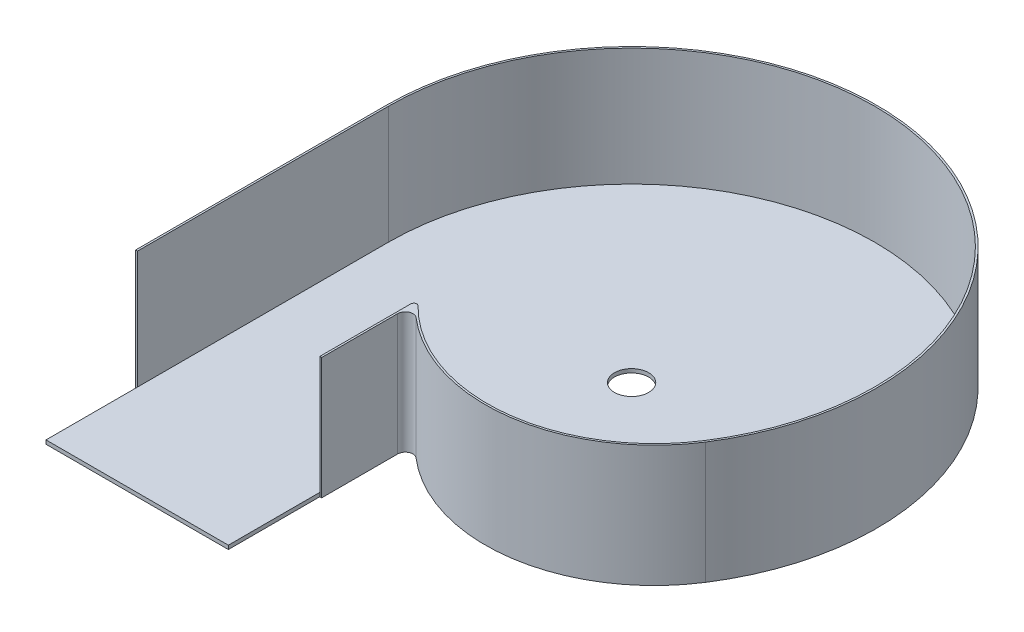
ISO-10303-21;
HEADER;
FILE_DESCRIPTION(('STEP AP214'),'2;1');
FILE_NAME('part.step','',(''),(''),'','','');
FILE_SCHEMA(('AUTOMOTIVE_DESIGN { 1 0 10303 214 1 1 1 1 }'));
ENDSEC;
DATA;
#1=APPLICATION_CONTEXT('core data for automotive mechanical design processes');
#2=APPLICATION_PROTOCOL_DEFINITION('international standard','automotive_design',2000,#1);
#3=PRODUCT_CONTEXT('',#1,'mechanical');
#4=PRODUCT('Part','Part','',(#3));
#5=PRODUCT_RELATED_PRODUCT_CATEGORY('part','',(#4));
#6=PRODUCT_DEFINITION_FORMATION('','',#4);
#7=PRODUCT_DEFINITION_CONTEXT('part definition',#1,'design');
#8=PRODUCT_DEFINITION('design','',#6,#7);
#9=PRODUCT_DEFINITION_SHAPE('','',#8);
#10=(LENGTH_UNIT() NAMED_UNIT(*) SI_UNIT(.MILLI.,.METRE.));
#11=(NAMED_UNIT(*) PLANE_ANGLE_UNIT() SI_UNIT($,.RADIAN.));
#12=(NAMED_UNIT(*) SI_UNIT($,.STERADIAN.) SOLID_ANGLE_UNIT());
#13=UNCERTAINTY_MEASURE_WITH_UNIT(LENGTH_MEASURE(1.E-05),#10,'distance_accuracy_value','');
#14=(GEOMETRIC_REPRESENTATION_CONTEXT(3) GLOBAL_UNCERTAINTY_ASSIGNED_CONTEXT((#13)) GLOBAL_UNIT_ASSIGNED_CONTEXT((#10,
#11,#12)) REPRESENTATION_CONTEXT('',''));
#15=CARTESIAN_POINT('',(0.,0.,0.));
#16=DIRECTION('',(0.,0.,1.));
#17=DIRECTION('',(1.,0.,0.));
#18=AXIS2_PLACEMENT_3D('',#15,#16,#17);
#19=CARTESIAN_POINT('',(0.,101.6,0.));
#20=DIRECTION('',(0.,-1.,0.));
#21=DIRECTION('',(0.,0.,-1.));
#22=AXIS2_PLACEMENT_3D('',#19,#20,#21);
#23=CYLINDRICAL_SURFACE('',#22,203.2);
#24=DIRECTION('',(0.,-1.,0.));
#25=VECTOR('',#24,1.);
#26=CARTESIAN_POINT('',(-203.2,101.6,0.));
#27=LINE('',#26,#25);
#28=CARTESIAN_POINT('',(-203.2,101.6,0.));
#29=VERTEX_POINT('',#28);
#30=CARTESIAN_POINT('',(-203.2,3.175,0.));
#31=VERTEX_POINT('',#30);
#32=EDGE_CURVE('E224',#29,#31,#27,.T.);
#33=ORIENTED_EDGE('',*,*,#32,.T.);
#34=CARTESIAN_POINT('',(0.,3.175,0.));
#35=DIRECTION('',(0.,1.,0.));
#36=DIRECTION('',(0.,0.,1.));
#37=AXIS2_PLACEMENT_3D('',#34,#35,#36);
#38=CIRCLE('',#37,203.2);
#39=CARTESIAN_POINT('',(170.948853632073,3.175,109.848666090582));
#40=VERTEX_POINT('',#39);
#41=EDGE_CURVE('E57',#40,#31,#38,.T.);
#42=ORIENTED_EDGE('',*,*,#41,.F.);
#43=DIRECTION('',(0.,-1.,0.));
#44=VECTOR('',#43,1.);
#45=CARTESIAN_POINT('',(170.948853632073,101.6,109.848666090582));
#46=LINE('',#45,#44);
#47=CARTESIAN_POINT('',(170.948853632073,101.6,109.848666090582));
#48=VERTEX_POINT('',#47);
#49=EDGE_CURVE('E11',#48,#40,#46,.T.);
#50=ORIENTED_EDGE('',*,*,#49,.F.);
#51=CARTESIAN_POINT('',(0.,101.6,0.));
#52=DIRECTION('',(0.,-1.,0.));
#53=DIRECTION('',(0.,0.,1.));
#54=AXIS2_PLACEMENT_3D('',#51,#52,#53);
#55=CIRCLE('',#54,203.2);
#56=EDGE_CURVE('E198',#29,#48,#55,.T.);
#57=ORIENTED_EDGE('',*,*,#56,.F.);
#58=EDGE_LOOP('',(#33,#42,#50,#57));
#59=FACE_BOUND('',#58,.T.);
#60=ADVANCED_FACE('F43',(#59),#23,.F.);
#61=CARTESIAN_POINT('',(53.4215167600227,101.6,34.3277081533069));
#62=DIRECTION('',(0.,-1.,0.));
#63=DIRECTION('',(0.,0.,-1.));
#64=AXIS2_PLACEMENT_3D('',#61,#62,#63);
#65=CYLINDRICAL_SURFACE('',#64,139.7);
#66=ORIENTED_EDGE('',*,*,#49,.T.);
#67=CARTESIAN_POINT('',(53.4215167600227,3.175,34.3277081533069));
#68=DIRECTION('',(0.,1.,0.));
#69=DIRECTION('',(0.,0.,1.));
#70=AXIS2_PLACEMENT_3D('',#67,#68,#69);
#71=CIRCLE('',#70,139.7);
#72=CARTESIAN_POINT('',(-46.4442586292853,3.175,132.01556259741));
#73=VERTEX_POINT('',#72);
#74=EDGE_CURVE('E63',#73,#40,#71,.T.);
#75=ORIENTED_EDGE('',*,*,#74,.F.);
#76=DIRECTION('',(0.,-1.,0.));
#77=VECTOR('',#76,1.);
#78=CARTESIAN_POINT('',(-46.4442586292853,101.6,132.01556259741));
#79=LINE('',#78,#77);
#80=CARTESIAN_POINT('',(-46.4442586292853,101.6,132.01556259741));
#81=VERTEX_POINT('',#80);
#82=EDGE_CURVE('E50',#81,#73,#79,.T.);
#83=ORIENTED_EDGE('',*,*,#82,.F.);
#84=CARTESIAN_POINT('',(53.4215167600227,101.6,34.3277081533069));
#85=DIRECTION('',(0.,-1.,0.));
#86=DIRECTION('',(0.,0.,1.));
#87=AXIS2_PLACEMENT_3D('',#84,#85,#86);
#88=CIRCLE('',#87,139.7);
#89=EDGE_CURVE('E201',#48,#81,#88,.T.);
#90=ORIENTED_EDGE('',*,*,#89,.F.);
#91=EDGE_LOOP('',(#66,#75,#83,#90));
#92=FACE_BOUND('',#91,.T.);
#93=ADVANCED_FACE('F293',(#92),#65,.F.);
#94=CARTESIAN_POINT('',(-48.26,101.6,133.791705405485));
#95=DIRECTION('',(0.,-1.,0.));
#96=DIRECTION('',(0.,0.,-1.));
#97=AXIS2_PLACEMENT_3D('',#94,#95,#96);
#98=CYLINDRICAL_SURFACE('',#97,2.54);
#99=ORIENTED_EDGE('',*,*,#82,.T.);
#100=CARTESIAN_POINT('',(-48.26,3.175,133.791705405485));
#101=DIRECTION('',(0.,-1.,0.));
#102=DIRECTION('',(0.,0.,1.));
#103=AXIS2_PLACEMENT_3D('',#100,#101,#102);
#104=CIRCLE('',#103,2.54);
#105=CARTESIAN_POINT('',(-50.8,3.175,133.791705405485));
#106=VERTEX_POINT('',#105);
#107=EDGE_CURVE('E182',#106,#73,#104,.T.);
#108=ORIENTED_EDGE('',*,*,#107,.F.);
#109=DIRECTION('',(0.,-1.,0.));
#110=VECTOR('',#109,1.);
#111=CARTESIAN_POINT('',(-50.8,101.6,133.791705405485));
#112=LINE('',#111,#110);
#113=CARTESIAN_POINT('',(-50.8,101.6,133.791705405485));
#114=VERTEX_POINT('',#113);
#115=EDGE_CURVE('E262',#114,#106,#112,.T.);
#116=ORIENTED_EDGE('',*,*,#115,.F.);
#117=CARTESIAN_POINT('',(-48.26,101.6,133.791705405485));
#118=DIRECTION('',(0.,1.,0.));
#119=DIRECTION('',(0.,0.,1.));
#120=AXIS2_PLACEMENT_3D('',#117,#118,#119);
#121=CIRCLE('',#120,2.54);
#122=EDGE_CURVE('E204',#81,#114,#121,.T.);
#123=ORIENTED_EDGE('',*,*,#122,.F.);
#124=EDGE_LOOP('',(#99,#108,#116,#123));
#125=FACE_BOUND('',#124,.T.);
#126=ADVANCED_FACE('F266',(#125),#98,.T.);
#127=CARTESIAN_POINT('',(-50.8,101.6,209.748302874768));
#128=DIRECTION('',(1.,0.,0.));
#129=DIRECTION('',(0.,0.,-1.));
#130=AXIS2_PLACEMENT_3D('',#127,#128,#129);
#131=PLANE('',#130);
#132=ORIENTED_EDGE('',*,*,#115,.T.);
#133=DIRECTION('',(0.,0.,-1.));
#134=VECTOR('',#133,1.);
#135=CARTESIAN_POINT('',(-50.8,3.175,133.791705405485));
#136=LINE('',#135,#134);
#137=CARTESIAN_POINT('',(-50.8,3.175,209.748302874768));
#138=VERTEX_POINT('',#137);
#139=EDGE_CURVE('E175',#138,#106,#136,.T.);
#140=ORIENTED_EDGE('',*,*,#139,.F.);
#141=DIRECTION('',(0.,-1.,0.));
#142=VECTOR('',#141,1.);
#143=CARTESIAN_POINT('',(-50.8,101.6,209.748302874768));
#144=LINE('',#143,#142);
#145=CARTESIAN_POINT('',(-50.8,101.6,209.748302874768));
#146=VERTEX_POINT('',#145);
#147=EDGE_CURVE('E259',#146,#138,#144,.T.);
#148=ORIENTED_EDGE('',*,*,#147,.F.);
#149=DIRECTION('',(0.,0.,1.));
#150=VECTOR('',#149,1.);
#151=CARTESIAN_POINT('',(-50.8,101.6,196.747553987337));
#152=LINE('',#151,#150);
#153=EDGE_CURVE('E206',#114,#146,#152,.T.);
#154=ORIENTED_EDGE('',*,*,#153,.F.);
#155=EDGE_LOOP('',(#132,#140,#148,#154));
#156=FACE_BOUND('',#155,.T.);
#157=ADVANCED_FACE('F270',(#156),#131,.F.);
#158=CARTESIAN_POINT('',(-49.2125,101.6,209.748302874768));
#159=DIRECTION('',(0.,0.,-1.));
#160=DIRECTION('',(-1.,0.,0.));
#161=AXIS2_PLACEMENT_3D('',#158,#159,#160);
#162=PLANE('',#161);
#163=DIRECTION('',(1.,0.,0.));
#164=VECTOR('',#163,1.);
#165=CARTESIAN_POINT('',(-49.2125,0.,209.748302874768));
#166=LINE('',#165,#164);
#167=CARTESIAN_POINT('',(-50.8,0.,209.748302874768));
#168=VERTEX_POINT('',#167);
#169=CARTESIAN_POINT('',(-49.2125,0.,209.748302874768));
#170=VERTEX_POINT('',#169);
#171=EDGE_CURVE('E197',#168,#170,#166,.T.);
#172=ORIENTED_EDGE('',*,*,#171,.T.);
#173=DIRECTION('',(0.,-1.,0.));
#174=VECTOR('',#173,1.);
#175=CARTESIAN_POINT('',(-49.2125,101.6,209.748302874768));
#176=LINE('',#175,#174);
#177=CARTESIAN_POINT('',(-49.2125,101.6,209.748302874768));
#178=VERTEX_POINT('',#177);
#179=EDGE_CURVE('E256',#178,#170,#176,.T.);
#180=ORIENTED_EDGE('',*,*,#179,.F.);
#181=DIRECTION('',(1.,0.,0.));
#182=VECTOR('',#181,1.);
#183=CARTESIAN_POINT('',(-49.2125,101.6,209.748302874768));
#184=LINE('',#183,#182);
#185=EDGE_CURVE('E208',#146,#178,#184,.T.);
#186=ORIENTED_EDGE('',*,*,#185,.F.);
#187=ORIENTED_EDGE('',*,*,#147,.T.);
#188=DIRECTION('',(0.,1.,0.));
#189=VECTOR('',#188,1.);
#190=CARTESIAN_POINT('',(-50.8,101.6,209.748302874768));
#191=LINE('',#190,#189);
#192=EDGE_CURVE('E169',#168,#138,#191,.T.);
#193=ORIENTED_EDGE('',*,*,#192,.F.);
#194=EDGE_LOOP('',(#172,#180,#186,#187,#193));
#195=FACE_BOUND('',#194,.T.);
#196=ADVANCED_FACE('F274',(#195),#162,.F.);
#197=CARTESIAN_POINT('',(-49.2125,101.6,146.248302874768));
#198=DIRECTION('',(-1.,0.,0.));
#199=DIRECTION('',(0.,0.,1.));
#200=AXIS2_PLACEMENT_3D('',#197,#198,#199);
#201=PLANE('',#200);
#202=DIRECTION('',(0.,0.,-1.));
#203=VECTOR('',#202,1.);
#204=CARTESIAN_POINT('',(-49.2125,0.,146.248302874768));
#205=LINE('',#204,#203);
#206=CARTESIAN_POINT('',(-49.2125,0.,146.248302874768));
#207=VERTEX_POINT('',#206);
#208=EDGE_CURVE('E226',#170,#207,#205,.T.);
#209=ORIENTED_EDGE('',*,*,#208,.T.);
#210=DIRECTION('',(0.,-1.,0.));
#211=VECTOR('',#210,1.);
#212=CARTESIAN_POINT('',(-49.2125,101.6,146.248302874768));
#213=LINE('',#212,#211);
#214=CARTESIAN_POINT('',(-49.2125,101.6,146.248302874768));
#215=VERTEX_POINT('',#214);
#216=EDGE_CURVE('E253',#215,#207,#213,.T.);
#217=ORIENTED_EDGE('',*,*,#216,.F.);
#218=DIRECTION('',(0.,0.,-1.));
#219=VECTOR('',#218,1.);
#220=CARTESIAN_POINT('',(-49.2125,101.6,146.248302874768));
#221=LINE('',#220,#219);
#222=EDGE_CURVE('E210',#178,#215,#221,.T.);
#223=ORIENTED_EDGE('',*,*,#222,.F.);
#224=ORIENTED_EDGE('',*,*,#179,.T.);
#225=EDGE_LOOP('',(#209,#217,#223,#224));
#226=FACE_BOUND('',#225,.T.);
#227=ADVANCED_FACE('F286',(#226),#201,.F.);
#228=CARTESIAN_POINT('',(-42.8625,101.6,146.248302874768));
#229=DIRECTION('',(0.,-1.,0.));
#230=DIRECTION('',(0.,0.,-1.));
#231=AXIS2_PLACEMENT_3D('',#228,#229,#230);
#232=CYLINDRICAL_SURFACE('',#231,6.34999999999997);
#233=CARTESIAN_POINT('',(-42.8625,0.,146.248302874768));
#234=DIRECTION('',(0.,-1.,0.));
#235=DIRECTION('',(0.,0.,-1.));
#236=AXIS2_PLACEMENT_3D('',#233,#234,#235);
#237=CIRCLE('',#236,6.34999999999997);
#238=CARTESIAN_POINT('',(-38.7212519673109,0.,141.434513854491));
#239=VERTEX_POINT('',#238);
#240=EDGE_CURVE('E228',#207,#239,#237,.T.);
#241=ORIENTED_EDGE('',*,*,#240,.T.);
#242=DIRECTION('',(0.,-1.,0.));
#243=VECTOR('',#242,1.);
#244=CARTESIAN_POINT('',(-38.7212519673109,101.6,141.434513854491));
#245=LINE('',#244,#243);
#246=CARTESIAN_POINT('',(-38.7212519673109,101.6,141.434513854491));
#247=VERTEX_POINT('',#246);
#248=EDGE_CURVE('E250',#247,#239,#245,.T.);
#249=ORIENTED_EDGE('',*,*,#248,.F.);
#250=CARTESIAN_POINT('',(-42.8625,101.6,146.248302874768));
#251=DIRECTION('',(0.,-1.,0.));
#252=DIRECTION('',(0.,0.,-1.));
#253=AXIS2_PLACEMENT_3D('',#250,#251,#252);
#254=CIRCLE('',#253,6.34999999999997);
#255=EDGE_CURVE('E212',#215,#247,#254,.T.);
#256=ORIENTED_EDGE('',*,*,#255,.F.);
#257=ORIENTED_EDGE('',*,*,#216,.T.);
#258=EDGE_LOOP('',(#241,#249,#256,#257));
#259=FACE_BOUND('',#258,.T.);
#260=ADVANCED_FACE('F336',(#259),#232,.F.);
#261=CARTESIAN_POINT('',(53.4215167600227,101.6,34.3277081533069));
#262=DIRECTION('',(0.,-1.,0.));
#263=DIRECTION('',(0.,0.,-1.));
#264=AXIS2_PLACEMENT_3D('',#261,#262,#263);
#265=CYLINDRICAL_SURFACE('',#264,141.2875);
#266=CARTESIAN_POINT('',(53.4215167600227,0.,34.3277081533069));
#267=DIRECTION('',(0.,1.,0.));
#268=DIRECTION('',(0.,0.,1.));
#269=AXIS2_PLACEMENT_3D('',#266,#267,#268);
#270=CIRCLE('',#269,141.2875);
#271=CARTESIAN_POINT('',(172.284391551073,0.,110.706858794415));
#272=VERTEX_POINT('',#271);
#273=EDGE_CURVE('E230',#239,#272,#270,.T.);
#274=ORIENTED_EDGE('',*,*,#273,.T.);
#275=DIRECTION('',(0.,-1.,0.));
#276=VECTOR('',#275,1.);
#277=CARTESIAN_POINT('',(172.284391551073,101.6,110.706858794415));
#278=LINE('',#277,#276);
#279=CARTESIAN_POINT('',(172.284391551073,101.6,110.706858794415));
#280=VERTEX_POINT('',#279);
#281=EDGE_CURVE('E247',#280,#272,#278,.T.);
#282=ORIENTED_EDGE('',*,*,#281,.F.);
#283=CARTESIAN_POINT('',(53.4215167600227,101.6,34.3277081533069));
#284=DIRECTION('',(0.,1.,0.));
#285=DIRECTION('',(0.,0.,1.));
#286=AXIS2_PLACEMENT_3D('',#283,#284,#285);
#287=CIRCLE('',#286,141.2875);
#288=EDGE_CURVE('E214',#247,#280,#287,.T.);
#289=ORIENTED_EDGE('',*,*,#288,.F.);
#290=ORIENTED_EDGE('',*,*,#248,.T.);
#291=EDGE_LOOP('',(#274,#282,#289,#290));
#292=FACE_BOUND('',#291,.T.);
#293=ADVANCED_FACE('F339',(#292),#265,.T.);
#294=CARTESIAN_POINT('',(0.,101.6,0.));
#295=DIRECTION('',(0.,-1.,0.));
#296=DIRECTION('',(0.,0.,-1.));
#297=AXIS2_PLACEMENT_3D('',#294,#295,#296);
#298=CYLINDRICAL_SURFACE('',#297,204.7875);
#299=CARTESIAN_POINT('',(0.,0.,0.));
#300=DIRECTION('',(0.,1.,0.));
#301=DIRECTION('',(0.,0.,1.));
#302=AXIS2_PLACEMENT_3D('',#299,#300,#301);
#303=CIRCLE('',#302,204.7875);
#304=CARTESIAN_POINT('',(-204.7875,0.,0.));
#305=VERTEX_POINT('',#304);
#306=EDGE_CURVE('E232',#272,#305,#303,.T.);
#307=ORIENTED_EDGE('',*,*,#306,.T.);
#308=DIRECTION('',(0.,-1.,0.));
#309=VECTOR('',#308,1.);
#310=CARTESIAN_POINT('',(-204.7875,101.6,0.));
#311=LINE('',#310,#309);
#312=CARTESIAN_POINT('',(-204.7875,101.6,0.));
#313=VERTEX_POINT('',#312);
#314=EDGE_CURVE('E244',#313,#305,#311,.T.);
#315=ORIENTED_EDGE('',*,*,#314,.F.);
#316=CARTESIAN_POINT('',(0.,101.6,0.));
#317=DIRECTION('',(0.,1.,0.));
#318=DIRECTION('',(0.,0.,1.));
#319=AXIS2_PLACEMENT_3D('',#316,#317,#318);
#320=CIRCLE('',#319,204.7875);
#321=EDGE_CURVE('E216',#280,#313,#320,.T.);
#322=ORIENTED_EDGE('',*,*,#321,.F.);
#323=ORIENTED_EDGE('',*,*,#281,.T.);
#324=EDGE_LOOP('',(#307,#315,#322,#323));
#325=FACE_BOUND('',#324,.T.);
#326=ADVANCED_FACE('F343',(#325),#298,.T.);
#327=CARTESIAN_POINT('',(-204.7875,101.6,0.));
#328=DIRECTION('',(1.,0.,0.));
#329=DIRECTION('',(0.,0.,-1.));
#330=AXIS2_PLACEMENT_3D('',#327,#328,#329);
#331=PLANE('',#330);
#332=DIRECTION('',(0.,0.,1.));
#333=VECTOR('',#332,1.);
#334=CARTESIAN_POINT('',(-204.7875,0.,0.));
#335=LINE('',#334,#333);
#336=CARTESIAN_POINT('',(-204.7875,0.,209.748302874768));
#337=VERTEX_POINT('',#336);
#338=EDGE_CURVE('E234',#305,#337,#335,.T.);
#339=ORIENTED_EDGE('',*,*,#338,.T.);
#340=DIRECTION('',(0.,-1.,0.));
#341=VECTOR('',#340,1.);
#342=CARTESIAN_POINT('',(-204.7875,101.6,209.748302874768));
#343=LINE('',#342,#341);
#344=CARTESIAN_POINT('',(-204.7875,101.6,209.748302874768));
#345=VERTEX_POINT('',#344);
#346=EDGE_CURVE('E241',#345,#337,#343,.T.);
#347=ORIENTED_EDGE('',*,*,#346,.F.);
#348=DIRECTION('',(0.,0.,1.));
#349=VECTOR('',#348,1.);
#350=CARTESIAN_POINT('',(-204.7875,101.6,0.));
#351=LINE('',#350,#349);
#352=EDGE_CURVE('E218',#313,#345,#351,.T.);
#353=ORIENTED_EDGE('',*,*,#352,.F.);
#354=ORIENTED_EDGE('',*,*,#314,.T.);
#355=EDGE_LOOP('',(#339,#347,#353,#354));
#356=FACE_BOUND('',#355,.T.);
#357=ADVANCED_FACE('F347',(#356),#331,.F.);
#358=CARTESIAN_POINT('',(-204.7875,101.6,209.748302874768));
#359=DIRECTION('',(0.,0.,-1.));
#360=DIRECTION('',(-1.,0.,0.));
#361=AXIS2_PLACEMENT_3D('',#358,#359,#360);
#362=PLANE('',#361);
#363=DIRECTION('',(1.,0.,0.));
#364=VECTOR('',#363,1.);
#365=CARTESIAN_POINT('',(-204.7875,0.,209.748302874768));
#366=LINE('',#365,#364);
#367=CARTESIAN_POINT('',(-203.2,0.,209.748302874768));
#368=VERTEX_POINT('',#367);
#369=EDGE_CURVE('E202',#337,#368,#366,.T.);
#370=ORIENTED_EDGE('',*,*,#369,.T.);
#371=DIRECTION('',(0.,-1.,0.));
#372=VECTOR('',#371,1.);
#373=CARTESIAN_POINT('',(-203.2,101.6,209.748302874768));
#374=LINE('',#373,#372);
#375=CARTESIAN_POINT('',(-203.2,3.175,209.748302874768));
#376=VERTEX_POINT('',#375);
#377=EDGE_CURVE('E195',#376,#368,#374,.T.);
#378=ORIENTED_EDGE('',*,*,#377,.F.);
#379=DIRECTION('',(0.,-1.,0.));
#380=VECTOR('',#379,1.);
#381=CARTESIAN_POINT('',(-203.2,101.6,209.748302874768));
#382=LINE('',#381,#380);
#383=CARTESIAN_POINT('',(-203.2,101.6,209.748302874768));
#384=VERTEX_POINT('',#383);
#385=EDGE_CURVE('E238',#384,#376,#382,.T.);
#386=ORIENTED_EDGE('',*,*,#385,.F.);
#387=DIRECTION('',(1.,0.,0.));
#388=VECTOR('',#387,1.);
#389=CARTESIAN_POINT('',(-204.7875,101.6,209.748302874768));
#390=LINE('',#389,#388);
#391=EDGE_CURVE('E220',#345,#384,#390,.T.);
#392=ORIENTED_EDGE('',*,*,#391,.F.);
#393=ORIENTED_EDGE('',*,*,#346,.T.);
#394=EDGE_LOOP('',(#370,#378,#386,#392,#393));
#395=FACE_BOUND('',#394,.T.);
#396=ADVANCED_FACE('F351',(#395),#362,.F.);
#397=CARTESIAN_POINT('',(-203.2,101.6,0.));
#398=DIRECTION('',(-1.,0.,0.));
#399=DIRECTION('',(0.,0.,1.));
#400=AXIS2_PLACEMENT_3D('',#397,#398,#399);
#401=PLANE('',#400);
#402=ORIENTED_EDGE('',*,*,#385,.T.);
#403=DIRECTION('',(0.,0.,1.));
#404=VECTOR('',#403,1.);
#405=CARTESIAN_POINT('',(-203.2,3.175,286.191705405485));
#406=LINE('',#405,#404);
#407=EDGE_CURVE('E158',#31,#376,#406,.T.);
#408=ORIENTED_EDGE('',*,*,#407,.F.);
#409=ORIENTED_EDGE('',*,*,#32,.F.);
#410=DIRECTION('',(0.,0.,-1.));
#411=VECTOR('',#410,1.);
#412=CARTESIAN_POINT('',(-203.2,101.6,0.));
#413=LINE('',#412,#411);
#414=EDGE_CURVE('E222',#384,#29,#413,.T.);
#415=ORIENTED_EDGE('',*,*,#414,.F.);
#416=EDGE_LOOP('',(#402,#408,#409,#415));
#417=FACE_BOUND('',#416,.T.);
#418=ADVANCED_FACE('F355',(#417),#401,.F.);
#419=CARTESIAN_POINT('',(0.,101.6,0.));
#420=DIRECTION('',(0.,1.,0.));
#421=DIRECTION('',(0.,0.,1.));
#422=AXIS2_PLACEMENT_3D('',#419,#420,#421);
#423=PLANE('',#422);
#424=ORIENTED_EDGE('',*,*,#56,.T.);
#425=ORIENTED_EDGE('',*,*,#89,.T.);
#426=ORIENTED_EDGE('',*,*,#122,.T.);
#427=ORIENTED_EDGE('',*,*,#153,.T.);
#428=ORIENTED_EDGE('',*,*,#185,.T.);
#429=ORIENTED_EDGE('',*,*,#222,.T.);
#430=ORIENTED_EDGE('',*,*,#255,.T.);
#431=ORIENTED_EDGE('',*,*,#288,.T.);
#432=ORIENTED_EDGE('',*,*,#321,.T.);
#433=ORIENTED_EDGE('',*,*,#352,.T.);
#434=ORIENTED_EDGE('',*,*,#391,.T.);
#435=ORIENTED_EDGE('',*,*,#414,.T.);
#436=EDGE_LOOP('',(#424,#425,#426,#427,#428,#429,#430,#431,#432,#433,#434,#435));
#437=FACE_BOUND('',#436,.T.);
#438=ADVANCED_FACE('F290',(#437),#423,.T.);
#439=CARTESIAN_POINT('',(0.,0.,0.));
#440=DIRECTION('',(0.,1.,0.));
#441=DIRECTION('',(0.,0.,1.));
#442=AXIS2_PLACEMENT_3D('',#439,#440,#441);
#443=PLANE('',#442);
#444=CARTESIAN_POINT('',(0.,0.,0.));
#445=DIRECTION('',(0.,1.,0.));
#446=DIRECTION('',(0.,0.,1.));
#447=AXIS2_PLACEMENT_3D('',#444,#445,#446);
#448=CIRCLE('',#447,14.2875);
#449=CARTESIAN_POINT('',(0.,0.,14.2875));
#450=VERTEX_POINT('',#449);
#451=EDGE_CURVE('E187',#450,#450,#448,.T.);
#452=ORIENTED_EDGE('',*,*,#451,.T.);
#453=EDGE_LOOP('',(#452));
#454=FACE_BOUND('',#453,.T.);
#455=ORIENTED_EDGE('',*,*,#171,.F.);
#456=DIRECTION('',(0.,0.,-1.));
#457=VECTOR('',#456,1.);
#458=CARTESIAN_POINT('',(-50.8,0.,133.791705405485));
#459=LINE('',#458,#457);
#460=CARTESIAN_POINT('',(-50.8,0.,286.191705405485));
#461=VERTEX_POINT('',#460);
#462=EDGE_CURVE('E189',#461,#168,#459,.T.);
#463=ORIENTED_EDGE('',*,*,#462,.F.);
#464=DIRECTION('',(1.,0.,0.));
#465=VECTOR('',#464,1.);
#466=CARTESIAN_POINT('',(-203.2,0.,286.191705405485));
#467=LINE('',#466,#465);
#468=CARTESIAN_POINT('',(-203.2,0.,286.191705405485));
#469=VERTEX_POINT('',#468);
#470=EDGE_CURVE('E186',#469,#461,#467,.T.);
#471=ORIENTED_EDGE('',*,*,#470,.F.);
#472=DIRECTION('',(0.,0.,1.));
#473=VECTOR('',#472,1.);
#474=CARTESIAN_POINT('',(-203.2,0.,286.191705405485));
#475=LINE('',#474,#473);
#476=EDGE_CURVE('E166',#368,#469,#475,.T.);
#477=ORIENTED_EDGE('',*,*,#476,.F.);
#478=ORIENTED_EDGE('',*,*,#369,.F.);
#479=ORIENTED_EDGE('',*,*,#338,.F.);
#480=ORIENTED_EDGE('',*,*,#306,.F.);
#481=ORIENTED_EDGE('',*,*,#273,.F.);
#482=ORIENTED_EDGE('',*,*,#240,.F.);
#483=ORIENTED_EDGE('',*,*,#208,.F.);
#484=EDGE_LOOP('',(#455,#463,#471,#477,#478,#479,#480,#481,#482,#483));
#485=FACE_BOUND('',#484,.T.);
#486=ADVANCED_FACE('F281',(#454,#485),#443,.F.);
#487=CARTESIAN_POINT('',(-203.2,3.175,286.191705405485));
#488=DIRECTION('',(1.,0.,0.));
#489=DIRECTION('',(0.,0.,-1.));
#490=AXIS2_PLACEMENT_3D('',#487,#488,#489);
#491=PLANE('',#490);
#492=CARTESIAN_POINT('',(-203.2,3.175,286.191705405485));
#493=VERTEX_POINT('',#492);
#494=EDGE_CURVE('E151',#376,#493,#406,.T.);
#495=ORIENTED_EDGE('',*,*,#494,.F.);
#496=ORIENTED_EDGE('',*,*,#377,.T.);
#497=ORIENTED_EDGE('',*,*,#476,.T.);
#498=DIRECTION('',(0.,-1.,0.));
#499=VECTOR('',#498,1.);
#500=CARTESIAN_POINT('',(-203.2,3.175,286.191705405485));
#501=LINE('',#500,#499);
#502=EDGE_CURVE('E163',#493,#469,#501,.T.);
#503=ORIENTED_EDGE('',*,*,#502,.F.);
#504=EDGE_LOOP('',(#495,#496,#497,#503));
#505=FACE_BOUND('',#504,.T.);
#506=ADVANCED_FACE('F164',(#505),#491,.F.);
#507=CARTESIAN_POINT('',(-50.8,3.175,133.791705405485));
#508=DIRECTION('',(-1.,0.,0.));
#509=DIRECTION('',(0.,0.,1.));
#510=AXIS2_PLACEMENT_3D('',#507,#508,#509);
#511=PLANE('',#510);
#512=ORIENTED_EDGE('',*,*,#462,.T.);
#513=ORIENTED_EDGE('',*,*,#192,.T.);
#514=CARTESIAN_POINT('',(-50.8,3.175,286.191705405485));
#515=VERTEX_POINT('',#514);
#516=EDGE_CURVE('E178',#515,#138,#136,.T.);
#517=ORIENTED_EDGE('',*,*,#516,.F.);
#518=DIRECTION('',(0.,-1.,0.));
#519=VECTOR('',#518,1.);
#520=CARTESIAN_POINT('',(-50.8,3.175,286.191705405485));
#521=LINE('',#520,#519);
#522=EDGE_CURVE('E170',#515,#461,#521,.T.);
#523=ORIENTED_EDGE('',*,*,#522,.T.);
#524=EDGE_LOOP('',(#512,#513,#517,#523));
#525=FACE_BOUND('',#524,.T.);
#526=ADVANCED_FACE('F278',(#525),#511,.F.);
#527=CARTESIAN_POINT('',(-203.2,3.175,286.191705405485));
#528=DIRECTION('',(0.,0.,-1.));
#529=DIRECTION('',(-1.,0.,0.));
#530=AXIS2_PLACEMENT_3D('',#527,#528,#529);
#531=PLANE('',#530);
#532=ORIENTED_EDGE('',*,*,#470,.T.);
#533=ORIENTED_EDGE('',*,*,#522,.F.);
#534=DIRECTION('',(1.,0.,0.));
#535=VECTOR('',#534,1.);
#536=CARTESIAN_POINT('',(-203.2,3.175,286.191705405485));
#537=LINE('',#536,#535);
#538=EDGE_CURVE('E156',#493,#515,#537,.T.);
#539=ORIENTED_EDGE('',*,*,#538,.F.);
#540=ORIENTED_EDGE('',*,*,#502,.T.);
#541=EDGE_LOOP('',(#532,#533,#539,#540));
#542=FACE_BOUND('',#541,.T.);
#543=ADVANCED_FACE('F172',(#542),#531,.F.);
#544=CARTESIAN_POINT('',(53.4215167600227,3.175,34.3277081533069));
#545=DIRECTION('',(0.,1.,0.));
#546=DIRECTION('',(0.,0.,1.));
#547=AXIS2_PLACEMENT_3D('',#544,#545,#546);
#548=PLANE('',#547);
#549=CARTESIAN_POINT('',(0.,3.175,0.));
#550=DIRECTION('',(0.,1.,0.));
#551=DIRECTION('',(0.,0.,1.));
#552=AXIS2_PLACEMENT_3D('',#549,#550,#551);
#553=CIRCLE('',#552,14.2875);
#554=CARTESIAN_POINT('',(0.,3.175,14.2875));
#555=VERTEX_POINT('',#554);
#556=EDGE_CURVE('E299',#555,#555,#553,.T.);
#557=ORIENTED_EDGE('',*,*,#556,.F.);
#558=EDGE_LOOP('',(#557));
#559=FACE_BOUND('',#558,.T.);
#560=ORIENTED_EDGE('',*,*,#74,.T.);
#561=ORIENTED_EDGE('',*,*,#41,.T.);
#562=ORIENTED_EDGE('',*,*,#407,.T.);
#563=ORIENTED_EDGE('',*,*,#494,.T.);
#564=ORIENTED_EDGE('',*,*,#538,.T.);
#565=ORIENTED_EDGE('',*,*,#516,.T.);
#566=ORIENTED_EDGE('',*,*,#139,.T.);
#567=ORIENTED_EDGE('',*,*,#107,.T.);
#568=EDGE_LOOP('',(#560,#561,#562,#563,#564,#565,#566,#567));
#569=FACE_BOUND('',#568,.T.);
#570=ADVANCED_FACE('F153',(#559,#569),#548,.T.);
#571=CARTESIAN_POINT('',(0.,0.,0.));
#572=DIRECTION('',(0.,1.,0.));
#573=DIRECTION('',(0.,0.,1.));
#574=AXIS2_PLACEMENT_3D('',#571,#572,#573);
#575=CYLINDRICAL_SURFACE('',#574,14.2875);
#576=ORIENTED_EDGE('',*,*,#451,.F.);
#577=EDGE_LOOP('',(#576));
#578=FACE_BOUND('',#577,.T.);
#579=ORIENTED_EDGE('',*,*,#556,.T.);
#580=EDGE_LOOP('',(#579));
#581=FACE_BOUND('',#580,.T.);
#582=ADVANCED_FACE('F306',(#578,#581),#575,.F.);
#583=CLOSED_SHELL('',(#60,#93,#126,#157,#196,#227,#260,#293,#326,#357,#396,#418,#438,#486,#506,
#526,#543,#570,#582));
#584=MANIFOLD_SOLID_BREP('B2',#583);
#585=ADVANCED_BREP_SHAPE_REPRESENTATION('',(#18,#584),#14);
#586=SHAPE_DEFINITION_REPRESENTATION(#9,#585);
ENDSEC;
END-ISO-10303-21;
